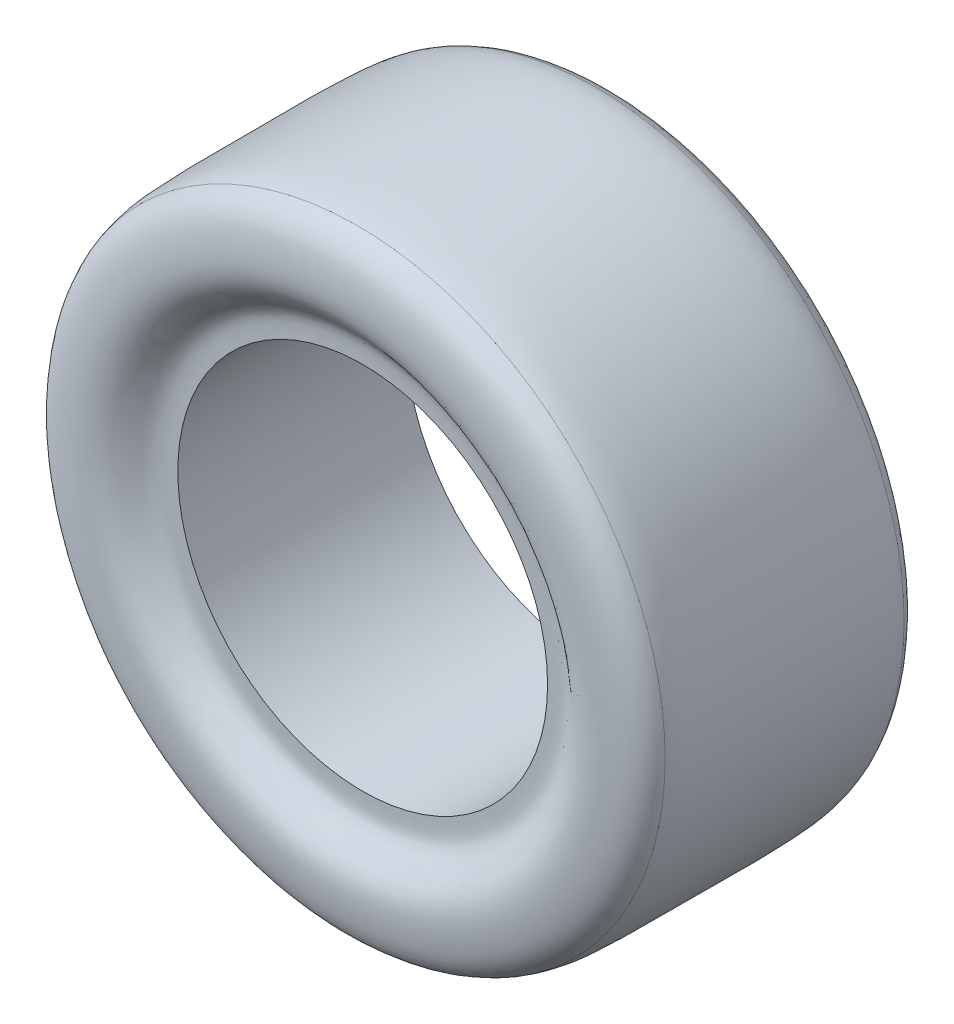
ISO-10303-21;
HEADER;
FILE_DESCRIPTION(('STEP AP214'),'2;1');
FILE_NAME('part.step','',(''),(''),'','','');
FILE_SCHEMA(('AUTOMOTIVE_DESIGN { 1 0 10303 214 1 1 1 1 }'));
ENDSEC;
DATA;
#1=APPLICATION_CONTEXT('core data for automotive mechanical design processes');
#2=APPLICATION_PROTOCOL_DEFINITION('international standard','automotive_design',2000,#1);
#3=PRODUCT_CONTEXT('',#1,'mechanical');
#4=PRODUCT('Part','Part','',(#3));
#5=PRODUCT_RELATED_PRODUCT_CATEGORY('part','',(#4));
#6=PRODUCT_DEFINITION_FORMATION('','',#4);
#7=PRODUCT_DEFINITION_CONTEXT('part definition',#1,'design');
#8=PRODUCT_DEFINITION('design','',#6,#7);
#9=PRODUCT_DEFINITION_SHAPE('','',#8);
#10=(LENGTH_UNIT() NAMED_UNIT(*) SI_UNIT(.MILLI.,.METRE.));
#11=(NAMED_UNIT(*) PLANE_ANGLE_UNIT() SI_UNIT($,.RADIAN.));
#12=(NAMED_UNIT(*) SI_UNIT($,.STERADIAN.) SOLID_ANGLE_UNIT());
#13=UNCERTAINTY_MEASURE_WITH_UNIT(LENGTH_MEASURE(1.E-05),#10,'distance_accuracy_value','');
#14=(GEOMETRIC_REPRESENTATION_CONTEXT(3) GLOBAL_UNCERTAINTY_ASSIGNED_CONTEXT((#13)) GLOBAL_UNIT_ASSIGNED_CONTEXT((#10,
#11,#12)) REPRESENTATION_CONTEXT('',''));
#15=CARTESIAN_POINT('',(0.,0.,0.));
#16=DIRECTION('',(0.,0.,1.));
#17=DIRECTION('',(1.,0.,0.));
#18=AXIS2_PLACEMENT_3D('',#15,#16,#17);
#19=CARTESIAN_POINT('',(0.,274.554941449193,106.620792157261));
#20=CARTESIAN_POINT('',(0.,269.037593882811,120.542100637152));
#21=CARTESIAN_POINT('',(0.,244.314856027019,127.338585019163));
#22=CARTESIAN_POINT('',(0.,209.006810584023,127.552208095372));
#23=CARTESIAN_POINT('',(0.,188.023063848027,101.948459634708));
#24=CARTESIAN_POINT('',(0.,176.073720116869,101.957725399221));
#25=CARTESIAN_POINT('',(0.,165.,102.));
#26=B_SPLINE_CURVE_WITH_KNOTS('',3,(#19,#20,#21,#22,#23,#24,#25),.UNSPECIFIED.,.F.,.F.,(4,1,1,1,
4),(0.,0.323709356193686,0.591317185190387,0.822619014527505,1.),.UNSPECIFIED.);
#27=CARTESIAN_POINT('',(0.,0.,146.251356053781));
#28=DIRECTION('',(0.,0.,1.));
#29=AXIS1_PLACEMENT('',#27,#28);
#30=SURFACE_OF_REVOLUTION('',#26,#29);
#31=CARTESIAN_POINT('',(0.,0.,102.));
#32=DIRECTION('',(0.,0.,1.));
#33=DIRECTION('',(1.,0.,0.));
#34=AXIS2_PLACEMENT_3D('',#31,#32,#33);
#35=CIRCLE('',#34,165.);
#36=CARTESIAN_POINT('',(165.,0.,102.));
#37=VERTEX_POINT('',#36);
#38=EDGE_CURVE('E67',#37,#37,#35,.T.);
#39=ORIENTED_EDGE('',*,*,#38,.F.);
#40=EDGE_LOOP('',(#39));
#41=FACE_BOUND('',#40,.T.);
#42=CARTESIAN_POINT('',(0.,0.,106.620792157261));
#43=DIRECTION('',(0.,0.,1.));
#44=DIRECTION('',(1.,0.,0.));
#45=AXIS2_PLACEMENT_3D('',#42,#43,#44);
#46=CIRCLE('',#45,274.554941449193);
#47=CARTESIAN_POINT('',(274.554941449193,0.,106.620792157261));
#48=VERTEX_POINT('',#47);
#49=EDGE_CURVE('E11',#48,#48,#46,.T.);
#50=ORIENTED_EDGE('',*,*,#49,.T.);
#51=EDGE_LOOP('',(#50));
#52=FACE_BOUND('',#51,.T.);
#53=ADVANCED_FACE('F44',(#41,#52),#30,.T.);
#54=CARTESIAN_POINT('',(0.,274.554941449193,106.620792157261));
#55=DIRECTION('',(0.,0.,1.));
#56=DIRECTION('',(1.,0.,0.));
#57=AXIS2_PLACEMENT_3D('',#54,#55,#56);
#58=PLANE('',#57);
#59=ORIENTED_EDGE('',*,*,#49,.F.);
#60=EDGE_LOOP('',(#59));
#61=FACE_BOUND('',#60,.T.);
#62=CARTESIAN_POINT('',(0.,0.,106.620792157261));
#63=DIRECTION('',(0.,0.,1.));
#64=DIRECTION('',(1.,0.,0.));
#65=AXIS2_PLACEMENT_3D('',#62,#63,#64);
#66=CIRCLE('',#65,212.539330500229);
#67=CARTESIAN_POINT('',(212.539330500229,0.,106.620792157261));
#68=VERTEX_POINT('',#67);
#69=EDGE_CURVE('E51',#68,#68,#66,.T.);
#70=ORIENTED_EDGE('',*,*,#69,.T.);
#71=EDGE_LOOP('',(#70));
#72=FACE_BOUND('',#71,.T.);
#73=ADVANCED_FACE('F92',(#61,#72),#58,.F.);
#74=CARTESIAN_POINT('',(0.,0.,146.251356053781));
#75=DIRECTION('',(0.,0.,1.));
#76=DIRECTION('',(1.,0.,0.));
#77=AXIS2_PLACEMENT_3D('',#74,#75,#76);
#78=CYLINDRICAL_SURFACE('',#77,212.539330500229);
#79=ORIENTED_EDGE('',*,*,#69,.F.);
#80=EDGE_LOOP('',(#79));
#81=FACE_BOUND('',#80,.T.);
#82=CARTESIAN_POINT('',(0.,0.,-106.620792160382));
#83=DIRECTION('',(0.,0.,1.));
#84=DIRECTION('',(1.,0.,0.));
#85=AXIS2_PLACEMENT_3D('',#82,#83,#84);
#86=CIRCLE('',#85,212.539330500229);
#87=CARTESIAN_POINT('',(212.539330500229,0.,-106.620792160382));
#88=VERTEX_POINT('',#87);
#89=EDGE_CURVE('E55',#88,#88,#86,.T.);
#90=ORIENTED_EDGE('',*,*,#89,.T.);
#91=EDGE_LOOP('',(#90));
#92=FACE_BOUND('',#91,.T.);
#93=ADVANCED_FACE('F89',(#81,#92),#78,.T.);
#94=CARTESIAN_POINT('',(0.,212.539330500229,-106.620792160382));
#95=DIRECTION('',(0.,0.,-1.));
#96=DIRECTION('',(-1.,0.,0.));
#97=AXIS2_PLACEMENT_3D('',#94,#95,#96);
#98=PLANE('',#97);
#99=ORIENTED_EDGE('',*,*,#89,.F.);
#100=EDGE_LOOP('',(#99));
#101=FACE_BOUND('',#100,.T.);
#102=CARTESIAN_POINT('',(0.,0.,-106.620792160382));
#103=DIRECTION('',(0.,0.,1.));
#104=DIRECTION('',(1.,0.,0.));
#105=AXIS2_PLACEMENT_3D('',#102,#103,#104);
#106=CIRCLE('',#105,274.554941447628);
#107=CARTESIAN_POINT('',(274.554941447628,0.,-106.620792160382));
#108=VERTEX_POINT('',#107);
#109=EDGE_CURVE('E59',#108,#108,#106,.T.);
#110=ORIENTED_EDGE('',*,*,#109,.T.);
#111=EDGE_LOOP('',(#110));
#112=FACE_BOUND('',#111,.T.);
#113=ADVANCED_FACE('F85',(#101,#112),#98,.F.);
#114=CARTESIAN_POINT('',(0.,165.,-102.));
#115=CARTESIAN_POINT('',(0.,177.060706388931,-101.576549126736));
#116=CARTESIAN_POINT('',(0.,186.927900399876,-102.069256279929));
#117=CARTESIAN_POINT('',(0.,207.871541467819,-125.863088008593));
#118=CARTESIAN_POINT('',(0.,242.234965694018,-128.238691629398));
#119=CARTESIAN_POINT('',(0.,268.779830316906,-121.073557118801));
#120=CARTESIAN_POINT('',(0.,274.554941447628,-106.620792160382));
#121=B_SPLINE_CURVE_WITH_KNOTS('',3,(#114,#115,#116,#117,#118,#119,#120),.UNSPECIFIED.,.F.,.F.,
(4,1,1,1,4),(0.,0.177655086642708,0.390747511208721,0.652934556380773,1.),.UNSPECIFIED.);
#122=CARTESIAN_POINT('',(0.,0.,146.251356053781));
#123=DIRECTION('',(0.,0.,1.));
#124=AXIS1_PLACEMENT('',#122,#123);
#125=SURFACE_OF_REVOLUTION('',#121,#124);
#126=ORIENTED_EDGE('',*,*,#109,.F.);
#127=EDGE_LOOP('',(#126));
#128=FACE_BOUND('',#127,.T.);
#129=CARTESIAN_POINT('',(0.,0.,-102.));
#130=DIRECTION('',(0.,0.,1.));
#131=DIRECTION('',(1.,0.,0.));
#132=AXIS2_PLACEMENT_3D('',#129,#130,#131);
#133=CIRCLE('',#132,165.);
#134=CARTESIAN_POINT('',(165.,0.,-102.));
#135=VERTEX_POINT('',#134);
#136=EDGE_CURVE('E64',#135,#135,#133,.T.);
#137=ORIENTED_EDGE('',*,*,#136,.T.);
#138=EDGE_LOOP('',(#137));
#139=FACE_BOUND('',#138,.T.);
#140=ADVANCED_FACE('F80',(#128,#139),#125,.T.);
#141=CARTESIAN_POINT('',(0.,0.,146.251356053781));
#142=DIRECTION('',(0.,0.,1.));
#143=DIRECTION('',(1.,0.,0.));
#144=AXIS2_PLACEMENT_3D('',#141,#142,#143);
#145=CYLINDRICAL_SURFACE('',#144,165.);
#146=ORIENTED_EDGE('',*,*,#136,.F.);
#147=EDGE_LOOP('',(#146));
#148=FACE_BOUND('',#147,.T.);
#149=ORIENTED_EDGE('',*,*,#38,.T.);
#150=EDGE_LOOP('',(#149));
#151=FACE_BOUND('',#150,.T.);
#152=ADVANCED_FACE('F84',(#148,#151),#145,.F.);
#153=CLOSED_SHELL('',(#53,#73,#93,#113,#140,#152));
#154=MANIFOLD_SOLID_BREP('B2',#153);
#155=CARTESIAN_POINT('',(0.,274.554941447628,-106.620792160382));
#156=CARTESIAN_POINT('',(0.,277.144766785031,-99.5752590080896));
#157=CARTESIAN_POINT('',(0.,279.731853568533,-60.3202776784093));
#158=CARTESIAN_POINT('',(0.,278.578377805426,-2.20309343020406));
#159=CARTESIAN_POINT('',(0.,279.44576755401,59.2348609472602));
#160=CARTESIAN_POINT('',(0.,277.547123349241,97.3451293155182));
#161=CARTESIAN_POINT('',(0.,274.554941449194,106.62079215726));
#162=B_SPLINE_CURVE_WITH_KNOTS('',3,(#155,#156,#157,#158,#159,#160,#161),.UNSPECIFIED.,.F.,.F.,
(4,1,1,1,4),(0.,0.123299436725303,0.500044301453851,0.849306923142953,1.),.UNSPECIFIED.);
#163=CARTESIAN_POINT('',(0.,0.,146.251356053781));
#164=DIRECTION('',(0.,0.,1.));
#165=AXIS1_PLACEMENT('',#163,#164);
#166=SURFACE_OF_REVOLUTION('',#162,#165);
#167=CARTESIAN_POINT('',(0.,0.,106.620792157261));
#168=DIRECTION('',(0.,0.,1.));
#169=DIRECTION('',(1.,0.,0.));
#170=AXIS2_PLACEMENT_3D('',#167,#168,#169);
#171=CIRCLE('',#170,274.554941449193);
#172=CARTESIAN_POINT('',(274.554941449193,0.,106.620792157261));
#173=VERTEX_POINT('',#172);
#174=EDGE_CURVE('E43',#173,#173,#171,.T.);
#175=ORIENTED_EDGE('',*,*,#174,.F.);
#176=EDGE_LOOP('',(#175));
#177=FACE_BOUND('',#176,.T.);
#178=CARTESIAN_POINT('',(0.,0.,-106.620792160382));
#179=DIRECTION('',(0.,0.,1.));
#180=DIRECTION('',(1.,0.,0.));
#181=AXIS2_PLACEMENT_3D('',#178,#179,#180);
#182=CIRCLE('',#181,274.554941447628);
#183=CARTESIAN_POINT('',(274.554941447628,0.,-106.620792160382));
#184=VERTEX_POINT('',#183);
#185=EDGE_CURVE('E176',#184,#184,#182,.T.);
#186=ORIENTED_EDGE('',*,*,#185,.T.);
#187=EDGE_LOOP('',(#186));
#188=FACE_BOUND('',#187,.T.);
#189=ADVANCED_FACE('F161',(#177,#188),#166,.T.);
#190=CARTESIAN_POINT('',(0.,274.554941449193,106.620792157261));
#191=DIRECTION('',(0.,0.,-1.));
#192=DIRECTION('',(-1.,0.,0.));
#193=AXIS2_PLACEMENT_3D('',#190,#191,#192);
#194=PLANE('',#193);
#195=CARTESIAN_POINT('',(0.,0.,106.620792157261));
#196=DIRECTION('',(0.,0.,1.));
#197=DIRECTION('',(1.,0.,0.));
#198=AXIS2_PLACEMENT_3D('',#195,#196,#197);
#199=CIRCLE('',#198,212.539330500229);
#200=CARTESIAN_POINT('',(212.539330500229,0.,106.620792157261));
#201=VERTEX_POINT('',#200);
#202=EDGE_CURVE('E168',#201,#201,#199,.T.);
#203=ORIENTED_EDGE('',*,*,#202,.F.);
#204=EDGE_LOOP('',(#203));
#205=FACE_BOUND('',#204,.T.);
#206=ORIENTED_EDGE('',*,*,#174,.T.);
#207=EDGE_LOOP('',(#206));
#208=FACE_BOUND('',#207,.T.);
#209=ADVANCED_FACE('F197',(#205,#208),#194,.F.);
#210=CARTESIAN_POINT('',(0.,0.,146.251356053781));
#211=DIRECTION('',(0.,0.,1.));
#212=DIRECTION('',(1.,0.,0.));
#213=AXIS2_PLACEMENT_3D('',#210,#211,#212);
#214=CYLINDRICAL_SURFACE('',#213,212.539330500229);
#215=CARTESIAN_POINT('',(0.,0.,-106.620792160382));
#216=DIRECTION('',(0.,0.,1.));
#217=DIRECTION('',(1.,0.,0.));
#218=AXIS2_PLACEMENT_3D('',#215,#216,#217);
#219=CIRCLE('',#218,212.539330500229);
#220=CARTESIAN_POINT('',(212.539330500229,0.,-106.620792160382));
#221=VERTEX_POINT('',#220);
#222=EDGE_CURVE('E172',#221,#221,#219,.T.);
#223=ORIENTED_EDGE('',*,*,#222,.F.);
#224=EDGE_LOOP('',(#223));
#225=FACE_BOUND('',#224,.T.);
#226=ORIENTED_EDGE('',*,*,#202,.T.);
#227=EDGE_LOOP('',(#226));
#228=FACE_BOUND('',#227,.T.);
#229=ADVANCED_FACE('F192',(#225,#228),#214,.F.);
#230=CARTESIAN_POINT('',(0.,212.539330500229,-106.620792160382));
#231=DIRECTION('',(0.,0.,1.));
#232=DIRECTION('',(1.,0.,0.));
#233=AXIS2_PLACEMENT_3D('',#230,#231,#232);
#234=PLANE('',#233);
#235=ORIENTED_EDGE('',*,*,#185,.F.);
#236=EDGE_LOOP('',(#235));
#237=FACE_BOUND('',#236,.T.);
#238=ORIENTED_EDGE('',*,*,#222,.T.);
#239=EDGE_LOOP('',(#238));
#240=FACE_BOUND('',#239,.T.);
#241=ADVANCED_FACE('F189',(#237,#240),#234,.F.);
#242=CLOSED_SHELL('',(#189,#209,#229,#241));
#243=MANIFOLD_SOLID_BREP('B6',#242);
#244=ADVANCED_BREP_SHAPE_REPRESENTATION('',(#18,#154,#243),#14);
#245=SHAPE_DEFINITION_REPRESENTATION(#9,#244);
ENDSEC;
END-ISO-10303-21;
